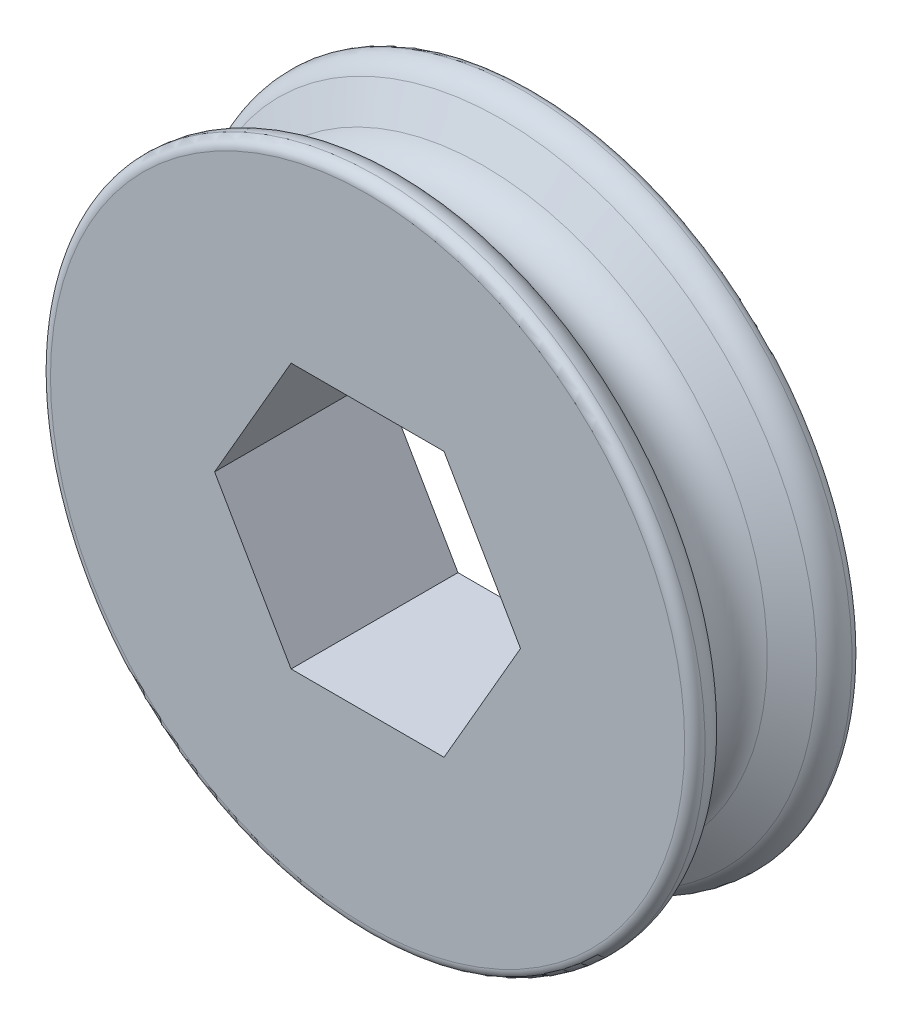
ISO-10303-21;
HEADER;
FILE_DESCRIPTION(('STEP AP214'),'2;1');
FILE_NAME('part.step','',(''),(''),'','','');
FILE_SCHEMA(('AUTOMOTIVE_DESIGN { 1 0 10303 214 1 1 1 1 }'));
ENDSEC;
DATA;
#1=APPLICATION_CONTEXT('core data for automotive mechanical design processes');
#2=APPLICATION_PROTOCOL_DEFINITION('international standard','automotive_design',2000,#1);
#3=PRODUCT_CONTEXT('',#1,'mechanical');
#4=PRODUCT('Part','Part','',(#3));
#5=PRODUCT_RELATED_PRODUCT_CATEGORY('part','',(#4));
#6=PRODUCT_DEFINITION_FORMATION('','',#4);
#7=PRODUCT_DEFINITION_CONTEXT('part definition',#1,'design');
#8=PRODUCT_DEFINITION('design','',#6,#7);
#9=PRODUCT_DEFINITION_SHAPE('','',#8);
#10=(LENGTH_UNIT() NAMED_UNIT(*) SI_UNIT(.MILLI.,.METRE.));
#11=(NAMED_UNIT(*) PLANE_ANGLE_UNIT() SI_UNIT($,.RADIAN.));
#12=(NAMED_UNIT(*) SI_UNIT($,.STERADIAN.) SOLID_ANGLE_UNIT());
#13=UNCERTAINTY_MEASURE_WITH_UNIT(LENGTH_MEASURE(1.E-05),#10,'distance_accuracy_value','');
#14=(GEOMETRIC_REPRESENTATION_CONTEXT(3) GLOBAL_UNCERTAINTY_ASSIGNED_CONTEXT((#13)) GLOBAL_UNIT_ASSIGNED_CONTEXT((#10,
#11,#12)) REPRESENTATION_CONTEXT('',''));
#15=CARTESIAN_POINT('',(0.,0.,0.));
#16=DIRECTION('',(0.,0.,1.));
#17=DIRECTION('',(1.,0.,0.));
#18=AXIS2_PLACEMENT_3D('',#15,#16,#17);
#19=CARTESIAN_POINT('',(0.,0.,-3.5000057));
#20=DIRECTION('',(0.,0.,-1.));
#21=DIRECTION('',(0.,1.,0.));
#22=AXIS2_PLACEMENT_3D('',#19,#20,#21);
#23=TOROIDAL_SURFACE('',#22,15.2006219074877,0.499999000000001);
#24=CARTESIAN_POINT('',(0.,0.,-3.52503594612087));
#25=DIRECTION('',(0.,0.,-1.));
#26=DIRECTION('',(0.,1.,0.));
#27=AXIS2_PLACEMENT_3D('',#24,#25,#26);
#28=CIRCLE('',#27,15.699994);
#29=CARTESIAN_POINT('',(0.,15.699994,-3.52503594612087));
#30=VERTEX_POINT('',#29);
#31=EDGE_CURVE('E11',#30,#30,#28,.T.);
#32=ORIENTED_EDGE('',*,*,#31,.T.);
#33=EDGE_LOOP('',(#32));
#34=FACE_BOUND('',#33,.T.);
#35=CARTESIAN_POINT('',(0.,0.,-4.0000047));
#36=DIRECTION('',(0.,0.,-1.));
#37=DIRECTION('',(0.,1.,0.));
#38=AXIS2_PLACEMENT_3D('',#35,#36,#37);
#39=CIRCLE('',#38,15.2006219074877);
#40=CARTESIAN_POINT('',(0.,15.2006219074877,-4.0000047));
#41=VERTEX_POINT('',#40);
#42=EDGE_CURVE('E133',#41,#41,#39,.T.);
#43=ORIENTED_EDGE('',*,*,#42,.F.);
#44=EDGE_LOOP('',(#43));
#45=FACE_BOUND('',#44,.T.);
#46=ADVANCED_FACE('F36',(#34,#45),#23,.T.);
#47=CARTESIAN_POINT('',(0.,0.,-3.46496335543078));
#48=DIRECTION('',(0.,0.,-1.));
#49=DIRECTION('',(0.,1.,0.));
#50=AXIS2_PLACEMENT_3D('',#47,#48,#49);
#51=TOROIDAL_SURFACE('',#50,14.5015009779704,1.1999976);
#52=CARTESIAN_POINT('',(0.,0.,-2.42573494935043));
#53=DIRECTION('',(0.,0.,-1.));
#54=DIRECTION('',(0.,1.,0.));
#55=AXIS2_PLACEMENT_3D('',#52,#53,#54);
#56=CIRCLE('',#55,15.1014997779704);
#57=CARTESIAN_POINT('',(0.,15.1014997779704,-2.42573494935042));
#58=VERTEX_POINT('',#57);
#59=EDGE_CURVE('E43',#58,#58,#56,.T.);
#60=ORIENTED_EDGE('',*,*,#59,.T.);
#61=EDGE_LOOP('',(#60));
#62=FACE_BOUND('',#61,.T.);
#63=ORIENTED_EDGE('',*,*,#31,.F.);
#64=EDGE_LOOP('',(#63));
#65=FACE_BOUND('',#64,.T.);
#66=ADVANCED_FACE('F160',(#62,#65),#51,.T.);
#67=CARTESIAN_POINT('',(0.,0.,-2.42573494935043));
#68=DIRECTION('',(0.,0.,-1.));
#69=DIRECTION('',(0.,1.,0.));
#70=AXIS2_PLACEMENT_3D('',#67,#68,#69);
#71=CONICAL_SURFACE('',#70,15.1014997779704,1.0471975511966);
#72=CARTESIAN_POINT('',(0.,0.,-1.55884260912054));
#73=DIRECTION('',(0.,0.,-1.));
#74=DIRECTION('',(0.,1.,0.));
#75=AXIS2_PLACEMENT_3D('',#72,#73,#74);
#76=CIRCLE('',#75,13.5999982);
#77=CARTESIAN_POINT('',(0.,13.5999982,-1.55884260912053));
#78=VERTEX_POINT('',#77);
#79=EDGE_CURVE('E155',#78,#78,#76,.T.);
#80=ORIENTED_EDGE('',*,*,#79,.T.);
#81=EDGE_LOOP('',(#80));
#82=FACE_BOUND('',#81,.T.);
#83=ORIENTED_EDGE('',*,*,#59,.F.);
#84=EDGE_LOOP('',(#83));
#85=FACE_BOUND('',#84,.T.);
#86=ADVANCED_FACE('F163',(#82,#85),#71,.T.);
#87=CARTESIAN_POINT('',(0.,0.,0.));
#88=DIRECTION('',(0.,0.,-1.));
#89=DIRECTION('',(0.,1.,0.));
#90=AXIS2_PLACEMENT_3D('',#87,#88,#89);
#91=TOROIDAL_SURFACE('',#90,14.4999964,1.7999964);
#92=CARTESIAN_POINT('',(0.,0.,1.55884260912053));
#93=DIRECTION('',(0.,0.,-1.));
#94=DIRECTION('',(0.,1.,0.));
#95=AXIS2_PLACEMENT_3D('',#92,#93,#94);
#96=CIRCLE('',#95,13.5999982);
#97=CARTESIAN_POINT('',(0.,13.5999982,1.55884260912053));
#98=VERTEX_POINT('',#97);
#99=EDGE_CURVE('E152',#98,#98,#96,.T.);
#100=ORIENTED_EDGE('',*,*,#99,.T.);
#101=EDGE_LOOP('',(#100));
#102=FACE_BOUND('',#101,.T.);
#103=ORIENTED_EDGE('',*,*,#79,.F.);
#104=EDGE_LOOP('',(#103));
#105=FACE_BOUND('',#104,.T.);
#106=ADVANCED_FACE('F165',(#102,#105),#91,.F.);
#107=CARTESIAN_POINT('',(0.,0.,1.55884260912053));
#108=DIRECTION('',(0.,0.,1.));
#109=DIRECTION('',(0.,-1.,0.));
#110=AXIS2_PLACEMENT_3D('',#107,#108,#109);
#111=CONICAL_SURFACE('',#110,13.5999982,1.0471975511966);
#112=CARTESIAN_POINT('',(0.,0.,2.42573494935042));
#113=DIRECTION('',(0.,0.,-1.));
#114=DIRECTION('',(0.,1.,0.));
#115=AXIS2_PLACEMENT_3D('',#112,#113,#114);
#116=CIRCLE('',#115,15.1014997779704);
#117=CARTESIAN_POINT('',(0.,15.1014997779704,2.42573494935042));
#118=VERTEX_POINT('',#117);
#119=EDGE_CURVE('E149',#118,#118,#116,.T.);
#120=ORIENTED_EDGE('',*,*,#119,.T.);
#121=EDGE_LOOP('',(#120));
#122=FACE_BOUND('',#121,.T.);
#123=ORIENTED_EDGE('',*,*,#99,.F.);
#124=EDGE_LOOP('',(#123));
#125=FACE_BOUND('',#124,.T.);
#126=ADVANCED_FACE('F172',(#122,#125),#111,.T.);
#127=CARTESIAN_POINT('',(0.,0.,3.46496335543078));
#128=DIRECTION('',(0.,0.,-1.));
#129=DIRECTION('',(0.,1.,0.));
#130=AXIS2_PLACEMENT_3D('',#127,#128,#129);
#131=TOROIDAL_SURFACE('',#130,14.5015009779704,1.1999976);
#132=CARTESIAN_POINT('',(0.,0.,3.52503594612087));
#133=DIRECTION('',(0.,0.,-1.));
#134=DIRECTION('',(0.,1.,0.));
#135=AXIS2_PLACEMENT_3D('',#132,#133,#134);
#136=CIRCLE('',#135,15.699994);
#137=CARTESIAN_POINT('',(0.,15.699994,3.52503594612087));
#138=VERTEX_POINT('',#137);
#139=EDGE_CURVE('E146',#138,#138,#136,.T.);
#140=ORIENTED_EDGE('',*,*,#139,.T.);
#141=EDGE_LOOP('',(#140));
#142=FACE_BOUND('',#141,.T.);
#143=ORIENTED_EDGE('',*,*,#119,.F.);
#144=EDGE_LOOP('',(#143));
#145=FACE_BOUND('',#144,.T.);
#146=ADVANCED_FACE('F198',(#142,#145),#131,.T.);
#147=CARTESIAN_POINT('',(0.,0.,3.5000057));
#148=DIRECTION('',(0.,0.,-1.));
#149=DIRECTION('',(0.,1.,0.));
#150=AXIS2_PLACEMENT_3D('',#147,#148,#149);
#151=TOROIDAL_SURFACE('',#150,15.2006219074877,0.499999000000001);
#152=CARTESIAN_POINT('',(0.,0.,4.0000047));
#153=DIRECTION('',(0.,0.,-1.));
#154=DIRECTION('',(0.,1.,0.));
#155=AXIS2_PLACEMENT_3D('',#152,#153,#154);
#156=CIRCLE('',#155,15.2006219074877);
#157=CARTESIAN_POINT('',(0.,15.2006219074877,4.0000047));
#158=VERTEX_POINT('',#157);
#159=EDGE_CURVE('E143',#158,#158,#156,.T.);
#160=ORIENTED_EDGE('',*,*,#159,.T.);
#161=EDGE_LOOP('',(#160));
#162=FACE_BOUND('',#161,.T.);
#163=ORIENTED_EDGE('',*,*,#139,.F.);
#164=EDGE_LOOP('',(#163));
#165=FACE_BOUND('',#164,.T.);
#166=ADVANCED_FACE('F191',(#162,#165),#151,.T.);
#167=CARTESIAN_POINT('',(0.,0.,4.0000047));
#168=DIRECTION('',(0.,0.,1.));
#169=DIRECTION('',(0.,-1.,0.));
#170=AXIS2_PLACEMENT_3D('',#167,#168,#169);
#171=PLANE('',#170);
#172=DIRECTION('',(0.5,0.866025403784439,0.));
#173=VECTOR('',#172,1.);
#174=CARTESIAN_POINT('',(3.66617420935412,-6.35,4.0000047));
#175=LINE('',#174,#173);
#176=CARTESIAN_POINT('',(3.66617420935412,-6.35,4.0000047));
#177=VERTEX_POINT('',#176);
#178=CARTESIAN_POINT('',(7.33234841870825,0.,4.0000047));
#179=VERTEX_POINT('',#178);
#180=EDGE_CURVE('E50',#177,#179,#175,.T.);
#181=ORIENTED_EDGE('',*,*,#180,.F.);
#182=DIRECTION('',(1.,0.,0.));
#183=VECTOR('',#182,1.);
#184=CARTESIAN_POINT('',(-3.66617420935413,-6.35,4.0000047));
#185=LINE('',#184,#183);
#186=CARTESIAN_POINT('',(-3.66617420935413,-6.35,4.0000047));
#187=VERTEX_POINT('',#186);
#188=EDGE_CURVE('E107',#187,#177,#185,.T.);
#189=ORIENTED_EDGE('',*,*,#188,.F.);
#190=DIRECTION('',(0.5,-0.866025403784439,0.));
#191=VECTOR('',#190,1.);
#192=CARTESIAN_POINT('',(-7.33234841870825,0.,4.0000047));
#193=LINE('',#192,#191);
#194=CARTESIAN_POINT('',(-7.33234841870825,0.,4.0000047));
#195=VERTEX_POINT('',#194);
#196=EDGE_CURVE('E110',#195,#187,#193,.T.);
#197=ORIENTED_EDGE('',*,*,#196,.F.);
#198=DIRECTION('',(-0.5,-0.866025403784439,0.));
#199=VECTOR('',#198,1.);
#200=CARTESIAN_POINT('',(-3.66617420935412,6.35,4.0000047));
#201=LINE('',#200,#199);
#202=CARTESIAN_POINT('',(-3.66617420935412,6.35,4.0000047));
#203=VERTEX_POINT('',#202);
#204=EDGE_CURVE('E126',#203,#195,#201,.T.);
#205=ORIENTED_EDGE('',*,*,#204,.F.);
#206=DIRECTION('',(-1.,0.,0.));
#207=VECTOR('',#206,1.);
#208=CARTESIAN_POINT('',(3.66617420935412,6.35,4.0000047));
#209=LINE('',#208,#207);
#210=CARTESIAN_POINT('',(3.66617420935412,6.35,4.0000047));
#211=VERTEX_POINT('',#210);
#212=EDGE_CURVE('E123',#211,#203,#209,.T.);
#213=ORIENTED_EDGE('',*,*,#212,.F.);
#214=DIRECTION('',(-0.5,0.866025403784439,0.));
#215=VECTOR('',#214,1.);
#216=CARTESIAN_POINT('',(7.33234841870825,0.,4.0000047));
#217=LINE('',#216,#215);
#218=EDGE_CURVE('E121',#179,#211,#217,.T.);
#219=ORIENTED_EDGE('',*,*,#218,.F.);
#220=EDGE_LOOP('',(#181,#189,#197,#205,#213,#219));
#221=FACE_BOUND('',#220,.T.);
#222=ORIENTED_EDGE('',*,*,#159,.F.);
#223=EDGE_LOOP('',(#222));
#224=FACE_BOUND('',#223,.T.);
#225=ADVANCED_FACE('F183',(#221,#224),#171,.T.);
#226=CARTESIAN_POINT('',(0.,0.,-4.0000047));
#227=DIRECTION('',(0.,0.,-1.));
#228=DIRECTION('',(0.,1.,0.));
#229=AXIS2_PLACEMENT_3D('',#226,#227,#228);
#230=PLANE('',#229);
#231=DIRECTION('',(0.5,0.866025403784439,0.));
#232=VECTOR('',#231,1.);
#233=CARTESIAN_POINT('',(3.66617420935412,-6.35,-4.0000047));
#234=LINE('',#233,#232);
#235=CARTESIAN_POINT('',(3.66617420935412,-6.35,-4.0000047));
#236=VERTEX_POINT('',#235);
#237=CARTESIAN_POINT('',(7.33234841870825,0.,-4.0000047));
#238=VERTEX_POINT('',#237);
#239=EDGE_CURVE('E90',#236,#238,#234,.T.);
#240=ORIENTED_EDGE('',*,*,#239,.T.);
#241=DIRECTION('',(-0.5,0.866025403784439,0.));
#242=VECTOR('',#241,1.);
#243=CARTESIAN_POINT('',(7.33234841870825,0.,-4.0000047));
#244=LINE('',#243,#242);
#245=CARTESIAN_POINT('',(3.66617420935412,6.35,-4.0000047));
#246=VERTEX_POINT('',#245);
#247=EDGE_CURVE('E99',#238,#246,#244,.T.);
#248=ORIENTED_EDGE('',*,*,#247,.T.);
#249=DIRECTION('',(-1.,0.,0.));
#250=VECTOR('',#249,1.);
#251=CARTESIAN_POINT('',(3.66617420935412,6.35,-4.0000047));
#252=LINE('',#251,#250);
#253=CARTESIAN_POINT('',(-3.66617420935412,6.35,-4.0000047));
#254=VERTEX_POINT('',#253);
#255=EDGE_CURVE('E58',#246,#254,#252,.T.);
#256=ORIENTED_EDGE('',*,*,#255,.T.);
#257=DIRECTION('',(-0.5,-0.866025403784439,0.));
#258=VECTOR('',#257,1.);
#259=CARTESIAN_POINT('',(-3.66617420935412,6.35,-4.0000047));
#260=LINE('',#259,#258);
#261=CARTESIAN_POINT('',(-7.33234841870825,0.,-4.0000047));
#262=VERTEX_POINT('',#261);
#263=EDGE_CURVE('E114',#254,#262,#260,.T.);
#264=ORIENTED_EDGE('',*,*,#263,.T.);
#265=DIRECTION('',(0.5,-0.866025403784439,0.));
#266=VECTOR('',#265,1.);
#267=CARTESIAN_POINT('',(-7.33234841870825,0.,-4.0000047));
#268=LINE('',#267,#266);
#269=CARTESIAN_POINT('',(-3.66617420935413,-6.35,-4.0000047));
#270=VERTEX_POINT('',#269);
#271=EDGE_CURVE('E117',#262,#270,#268,.T.);
#272=ORIENTED_EDGE('',*,*,#271,.T.);
#273=DIRECTION('',(1.,0.,0.));
#274=VECTOR('',#273,1.);
#275=CARTESIAN_POINT('',(-3.66617420935413,-6.35,-4.0000047));
#276=LINE('',#275,#274);
#277=EDGE_CURVE('E96',#270,#236,#276,.T.);
#278=ORIENTED_EDGE('',*,*,#277,.T.);
#279=EDGE_LOOP('',(#240,#248,#256,#264,#272,#278));
#280=FACE_BOUND('',#279,.T.);
#281=ORIENTED_EDGE('',*,*,#42,.T.);
#282=EDGE_LOOP('',(#281));
#283=FACE_BOUND('',#282,.T.);
#284=ADVANCED_FACE('F103',(#280,#283),#230,.T.);
#285=CARTESIAN_POINT('',(3.66617420935412,-6.35,-4.0000047));
#286=DIRECTION('',(0.866025403784439,-0.5,0.));
#287=DIRECTION('',(0.5,0.866025403784439,0.));
#288=AXIS2_PLACEMENT_3D('',#285,#286,#287);
#289=PLANE('',#288);
#290=ORIENTED_EDGE('',*,*,#180,.T.);
#291=DIRECTION('',(0.,0.,1.));
#292=VECTOR('',#291,1.);
#293=CARTESIAN_POINT('',(7.33234841870825,0.,-4.0000047));
#294=LINE('',#293,#292);
#295=EDGE_CURVE('E86',#238,#179,#294,.T.);
#296=ORIENTED_EDGE('',*,*,#295,.F.);
#297=ORIENTED_EDGE('',*,*,#239,.F.);
#298=DIRECTION('',(0.,0.,1.));
#299=VECTOR('',#298,1.);
#300=CARTESIAN_POINT('',(3.66617420935412,-6.35,-4.0000047));
#301=LINE('',#300,#299);
#302=EDGE_CURVE('E131',#236,#177,#301,.T.);
#303=ORIENTED_EDGE('',*,*,#302,.T.);
#304=EDGE_LOOP('',(#290,#296,#297,#303));
#305=FACE_BOUND('',#304,.T.);
#306=ADVANCED_FACE('F88',(#305),#289,.F.);
#307=CARTESIAN_POINT('',(-3.66617420935413,-6.35,-4.0000047));
#308=DIRECTION('',(0.,-1.,0.));
#309=DIRECTION('',(1.,0.,0.));
#310=AXIS2_PLACEMENT_3D('',#307,#308,#309);
#311=PLANE('',#310);
#312=ORIENTED_EDGE('',*,*,#188,.T.);
#313=ORIENTED_EDGE('',*,*,#302,.F.);
#314=ORIENTED_EDGE('',*,*,#277,.F.);
#315=DIRECTION('',(0.,0.,1.));
#316=VECTOR('',#315,1.);
#317=CARTESIAN_POINT('',(-3.66617420935413,-6.35,-4.0000047));
#318=LINE('',#317,#316);
#319=EDGE_CURVE('E134',#270,#187,#318,.T.);
#320=ORIENTED_EDGE('',*,*,#319,.T.);
#321=EDGE_LOOP('',(#312,#313,#314,#320));
#322=FACE_BOUND('',#321,.T.);
#323=ADVANCED_FACE('F189',(#322),#311,.F.);
#324=CARTESIAN_POINT('',(-7.33234841870825,0.,-4.0000047));
#325=DIRECTION('',(-0.866025403784439,-0.5,0.));
#326=DIRECTION('',(0.5,-0.866025403784439,0.));
#327=AXIS2_PLACEMENT_3D('',#324,#325,#326);
#328=PLANE('',#327);
#329=ORIENTED_EDGE('',*,*,#196,.T.);
#330=ORIENTED_EDGE('',*,*,#319,.F.);
#331=ORIENTED_EDGE('',*,*,#271,.F.);
#332=DIRECTION('',(0.,0.,1.));
#333=VECTOR('',#332,1.);
#334=CARTESIAN_POINT('',(-7.33234841870825,0.,-4.0000047));
#335=LINE('',#334,#333);
#336=EDGE_CURVE('E136',#262,#195,#335,.T.);
#337=ORIENTED_EDGE('',*,*,#336,.T.);
#338=EDGE_LOOP('',(#329,#330,#331,#337));
#339=FACE_BOUND('',#338,.T.);
#340=ADVANCED_FACE('F246',(#339),#328,.F.);
#341=CARTESIAN_POINT('',(-3.66617420935412,6.35,-4.0000047));
#342=DIRECTION('',(-0.866025403784439,0.5,0.));
#343=DIRECTION('',(-0.5,-0.866025403784439,0.));
#344=AXIS2_PLACEMENT_3D('',#341,#342,#343);
#345=PLANE('',#344);
#346=ORIENTED_EDGE('',*,*,#204,.T.);
#347=ORIENTED_EDGE('',*,*,#336,.F.);
#348=ORIENTED_EDGE('',*,*,#263,.F.);
#349=DIRECTION('',(0.,0.,1.));
#350=VECTOR('',#349,1.);
#351=CARTESIAN_POINT('',(-3.66617420935412,6.35,-4.0000047));
#352=LINE('',#351,#350);
#353=EDGE_CURVE('E138',#254,#203,#352,.T.);
#354=ORIENTED_EDGE('',*,*,#353,.T.);
#355=EDGE_LOOP('',(#346,#347,#348,#354));
#356=FACE_BOUND('',#355,.T.);
#357=ADVANCED_FACE('F256',(#356),#345,.F.);
#358=CARTESIAN_POINT('',(3.66617420935412,6.35,-4.0000047));
#359=DIRECTION('',(0.,1.,0.));
#360=DIRECTION('',(-1.,0.,0.));
#361=AXIS2_PLACEMENT_3D('',#358,#359,#360);
#362=PLANE('',#361);
#363=ORIENTED_EDGE('',*,*,#212,.T.);
#364=ORIENTED_EDGE('',*,*,#353,.F.);
#365=ORIENTED_EDGE('',*,*,#255,.F.);
#366=DIRECTION('',(0.,0.,1.));
#367=VECTOR('',#366,1.);
#368=CARTESIAN_POINT('',(3.66617420935412,6.35,-4.0000047));
#369=LINE('',#368,#367);
#370=EDGE_CURVE('E95',#246,#211,#369,.T.);
#371=ORIENTED_EDGE('',*,*,#370,.T.);
#372=EDGE_LOOP('',(#363,#364,#365,#371));
#373=FACE_BOUND('',#372,.T.);
#374=ADVANCED_FACE('F266',(#373),#362,.F.);
#375=CARTESIAN_POINT('',(7.33234841870825,0.,-4.0000047));
#376=DIRECTION('',(0.866025403784439,0.5,0.));
#377=DIRECTION('',(-0.5,0.866025403784439,0.));
#378=AXIS2_PLACEMENT_3D('',#375,#376,#377);
#379=PLANE('',#378);
#380=ORIENTED_EDGE('',*,*,#218,.T.);
#381=ORIENTED_EDGE('',*,*,#370,.F.);
#382=ORIENTED_EDGE('',*,*,#247,.F.);
#383=ORIENTED_EDGE('',*,*,#295,.T.);
#384=EDGE_LOOP('',(#380,#381,#382,#383));
#385=FACE_BOUND('',#384,.T.);
#386=ADVANCED_FACE('F100',(#385),#379,.F.);
#387=CLOSED_SHELL('',(#46,#66,#86,#106,#126,#146,#166,#225,#284,#306,#323,#340,#357,#374,#386));
#388=MANIFOLD_SOLID_BREP('B2',#387);
#389=ADVANCED_BREP_SHAPE_REPRESENTATION('',(#18,#388),#14);
#390=SHAPE_DEFINITION_REPRESENTATION(#9,#389);
ENDSEC;
END-ISO-10303-21;
